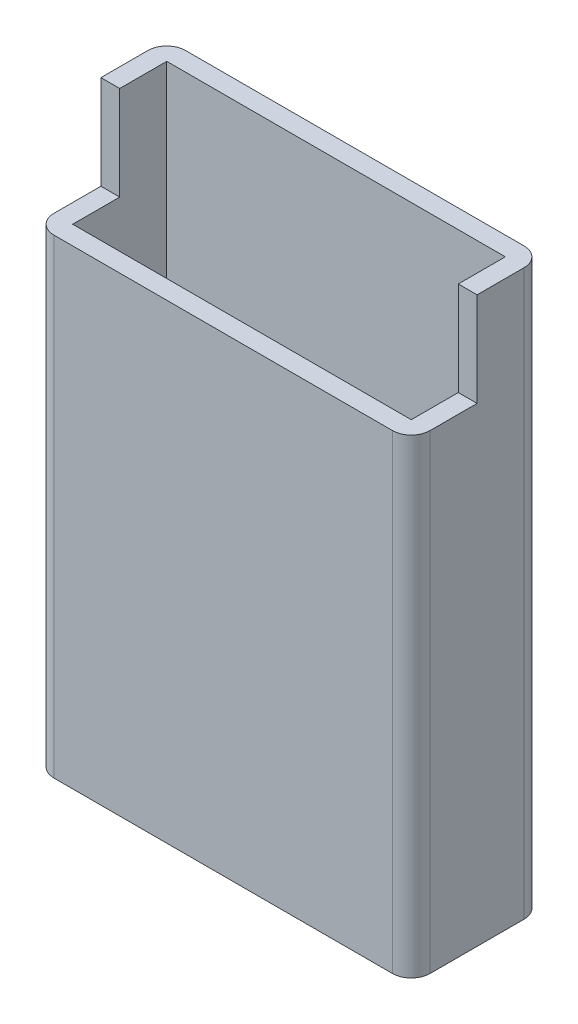
ISO-10303-21;
HEADER;
FILE_DESCRIPTION(('STEP AP214'),'2;1');
FILE_NAME('part.step','',(''),(''),'','','');
FILE_SCHEMA(('AUTOMOTIVE_DESIGN { 1 0 10303 214 1 1 1 1 }'));
ENDSEC;
DATA;
#1=APPLICATION_CONTEXT('core data for automotive mechanical design processes');
#2=APPLICATION_PROTOCOL_DEFINITION('international standard','automotive_design',2000,#1);
#3=PRODUCT_CONTEXT('',#1,'mechanical');
#4=PRODUCT('Part','Part','',(#3));
#5=PRODUCT_RELATED_PRODUCT_CATEGORY('part','',(#4));
#6=PRODUCT_DEFINITION_FORMATION('','',#4);
#7=PRODUCT_DEFINITION_CONTEXT('part definition',#1,'design');
#8=PRODUCT_DEFINITION('design','',#6,#7);
#9=PRODUCT_DEFINITION_SHAPE('','',#8);
#10=(LENGTH_UNIT() NAMED_UNIT(*) SI_UNIT(.MILLI.,.METRE.));
#11=(NAMED_UNIT(*) PLANE_ANGLE_UNIT() SI_UNIT($,.RADIAN.));
#12=(NAMED_UNIT(*) SI_UNIT($,.STERADIAN.) SOLID_ANGLE_UNIT());
#13=UNCERTAINTY_MEASURE_WITH_UNIT(LENGTH_MEASURE(1.E-05),#10,'distance_accuracy_value','');
#14=(GEOMETRIC_REPRESENTATION_CONTEXT(3) GLOBAL_UNCERTAINTY_ASSIGNED_CONTEXT((#13)) GLOBAL_UNIT_ASSIGNED_CONTEXT((#10,
#11,#12)) REPRESENTATION_CONTEXT('',''));
#15=CARTESIAN_POINT('',(0.,0.,0.));
#16=DIRECTION('',(0.,0.,1.));
#17=DIRECTION('',(1.,0.,0.));
#18=AXIS2_PLACEMENT_3D('',#15,#16,#17);
#19=CARTESIAN_POINT('',(0.,60.,0.));
#20=DIRECTION('',(0.,1.,0.));
#21=DIRECTION('',(0.,0.,1.));
#22=AXIS2_PLACEMENT_3D('',#19,#20,#21);
#23=PLANE('',#22);
#24=DIRECTION('',(0.,0.,1.));
#25=VECTOR('',#24,1.);
#26=CARTESIAN_POINT('',(40.,60.,-14.));
#27=LINE('',#26,#25);
#28=CARTESIAN_POINT('',(40.,60.,-12.));
#29=VERTEX_POINT('',#28);
#30=CARTESIAN_POINT('',(40.,60.,-7.));
#31=VERTEX_POINT('',#30);
#32=EDGE_CURVE('E161',#29,#31,#27,.T.);
#33=ORIENTED_EDGE('',*,*,#32,.F.);
#34=CARTESIAN_POINT('',(38.,60.,-12.));
#35=DIRECTION('',(0.,-1.,0.));
#36=DIRECTION('',(0.,0.,-1.));
#37=AXIS2_PLACEMENT_3D('',#34,#35,#36);
#38=CIRCLE('',#37,2.);
#39=CARTESIAN_POINT('',(38.,60.,-14.));
#40=VERTEX_POINT('',#39);
#41=EDGE_CURVE('E146',#40,#29,#38,.T.);
#42=ORIENTED_EDGE('',*,*,#41,.F.);
#43=DIRECTION('',(1.,0.,0.));
#44=VECTOR('',#43,1.);
#45=CARTESIAN_POINT('',(0.,60.,-14.));
#46=LINE('',#45,#44);
#47=CARTESIAN_POINT('',(2.00000000000001,60.,-14.));
#48=VERTEX_POINT('',#47);
#49=EDGE_CURVE('E171',#48,#40,#46,.T.);
#50=ORIENTED_EDGE('',*,*,#49,.F.);
#51=CARTESIAN_POINT('',(2.,60.,-12.));
#52=DIRECTION('',(0.,-1.,0.));
#53=DIRECTION('',(0.,0.,1.));
#54=AXIS2_PLACEMENT_3D('',#51,#52,#53);
#55=CIRCLE('',#54,2.);
#56=CARTESIAN_POINT('',(0.,60.,-12.));
#57=VERTEX_POINT('',#56);
#58=EDGE_CURVE('E154',#57,#48,#55,.T.);
#59=ORIENTED_EDGE('',*,*,#58,.F.);
#60=DIRECTION('',(0.,0.,1.));
#61=VECTOR('',#60,1.);
#62=CARTESIAN_POINT('',(0.,60.,-14.));
#63=LINE('',#62,#61);
#64=CARTESIAN_POINT('',(0.,60.,-7.));
#65=VERTEX_POINT('',#64);
#66=EDGE_CURVE('E172',#57,#65,#63,.T.);
#67=ORIENTED_EDGE('',*,*,#66,.T.);
#68=DIRECTION('',(-1.,0.,0.));
#69=VECTOR('',#68,1.);
#70=CARTESIAN_POINT('',(0.,60.,-7.));
#71=LINE('',#70,#69);
#72=CARTESIAN_POINT('',(2.,60.,-7.));
#73=VERTEX_POINT('',#72);
#74=EDGE_CURVE('E274',#73,#65,#71,.T.);
#75=ORIENTED_EDGE('',*,*,#74,.F.);
#76=DIRECTION('',(0.,0.,-1.));
#77=VECTOR('',#76,1.);
#78=CARTESIAN_POINT('',(2.,60.,-2.));
#79=LINE('',#78,#77);
#80=CARTESIAN_POINT('',(2.,60.,-12.));
#81=VERTEX_POINT('',#80);
#82=EDGE_CURVE('E235',#73,#81,#79,.T.);
#83=ORIENTED_EDGE('',*,*,#82,.T.);
#84=DIRECTION('',(1.,0.,0.));
#85=VECTOR('',#84,1.);
#86=CARTESIAN_POINT('',(2.,60.,-12.));
#87=LINE('',#86,#85);
#88=CARTESIAN_POINT('',(38.,60.,-12.));
#89=VERTEX_POINT('',#88);
#90=EDGE_CURVE('E250',#81,#89,#87,.T.);
#91=ORIENTED_EDGE('',*,*,#90,.T.);
#92=DIRECTION('',(0.,0.,-1.));
#93=VECTOR('',#92,1.);
#94=CARTESIAN_POINT('',(38.,60.,-2.));
#95=LINE('',#94,#93);
#96=CARTESIAN_POINT('',(38.,60.,-7.));
#97=VERTEX_POINT('',#96);
#98=EDGE_CURVE('E240',#97,#89,#95,.T.);
#99=ORIENTED_EDGE('',*,*,#98,.F.);
#100=EDGE_CURVE('E170',#31,#97,#71,.T.);
#101=ORIENTED_EDGE('',*,*,#100,.F.);
#102=EDGE_LOOP('',(#33,#42,#50,#59,#67,#75,#83,#91,#99,#101));
#103=FACE_BOUND('',#102,.T.);
#104=ADVANCED_FACE('F36',(#103),#23,.T.);
#105=CARTESIAN_POINT('',(0.,60.,-14.));
#106=DIRECTION('',(1.,0.,0.));
#107=DIRECTION('',(0.,0.,-1.));
#108=AXIS2_PLACEMENT_3D('',#105,#106,#107);
#109=PLANE('',#108);
#110=ORIENTED_EDGE('',*,*,#66,.F.);
#111=DIRECTION('',(0.,-1.,0.));
#112=VECTOR('',#111,1.);
#113=CARTESIAN_POINT('',(0.,60.,-12.));
#114=LINE('',#113,#112);
#115=CARTESIAN_POINT('',(0.,0.,-12.));
#116=VERTEX_POINT('',#115);
#117=EDGE_CURVE('E289',#57,#116,#114,.T.);
#118=ORIENTED_EDGE('',*,*,#117,.T.);
#119=DIRECTION('',(0.,0.,1.));
#120=VECTOR('',#119,1.);
#121=CARTESIAN_POINT('',(0.,0.,-14.));
#122=LINE('',#121,#120);
#123=CARTESIAN_POINT('',(0.,0.,-2.00000000000001));
#124=VERTEX_POINT('',#123);
#125=EDGE_CURVE('E180',#116,#124,#122,.T.);
#126=ORIENTED_EDGE('',*,*,#125,.T.);
#127=DIRECTION('',(0.,-1.,0.));
#128=VECTOR('',#127,1.);
#129=CARTESIAN_POINT('',(0.,60.,-2.00000000000001));
#130=LINE('',#129,#128);
#131=CARTESIAN_POINT('',(0.,50.,-2.00000000000001));
#132=VERTEX_POINT('',#131);
#133=EDGE_CURVE('E287',#132,#124,#130,.T.);
#134=ORIENTED_EDGE('',*,*,#133,.F.);
#135=DIRECTION('',(0.,0.,1.));
#136=VECTOR('',#135,1.);
#137=CARTESIAN_POINT('',(0.,50.,-7.));
#138=LINE('',#137,#136);
#139=CARTESIAN_POINT('',(0.,50.,-7.));
#140=VERTEX_POINT('',#139);
#141=EDGE_CURVE('E226',#140,#132,#138,.T.);
#142=ORIENTED_EDGE('',*,*,#141,.F.);
#143=DIRECTION('',(0.,-1.,0.));
#144=VECTOR('',#143,1.);
#145=CARTESIAN_POINT('',(0.,60.,-7.));
#146=LINE('',#145,#144);
#147=EDGE_CURVE('E214',#65,#140,#146,.T.);
#148=ORIENTED_EDGE('',*,*,#147,.F.);
#149=EDGE_LOOP('',(#110,#118,#126,#134,#142,#148));
#150=FACE_BOUND('',#149,.T.);
#151=ADVANCED_FACE('F38',(#150),#109,.F.);
#152=CARTESIAN_POINT('',(0.,60.,0.));
#153=DIRECTION('',(0.,0.,-1.));
#154=DIRECTION('',(-1.,0.,0.));
#155=AXIS2_PLACEMENT_3D('',#152,#153,#154);
#156=PLANE('',#155);
#157=DIRECTION('',(1.,0.,0.));
#158=VECTOR('',#157,1.);
#159=CARTESIAN_POINT('',(0.,50.,0.));
#160=LINE('',#159,#158);
#161=CARTESIAN_POINT('',(2.00000000000001,50.,0.));
#162=VERTEX_POINT('',#161);
#163=CARTESIAN_POINT('',(38.,50.,0.));
#164=VERTEX_POINT('',#163);
#165=EDGE_CURVE('E207',#162,#164,#160,.T.);
#166=ORIENTED_EDGE('',*,*,#165,.F.);
#167=DIRECTION('',(0.,-1.,0.));
#168=VECTOR('',#167,1.);
#169=CARTESIAN_POINT('',(2.00000000000001,60.,0.));
#170=LINE('',#169,#168);
#171=CARTESIAN_POINT('',(2.00000000000001,0.,0.));
#172=VERTEX_POINT('',#171);
#173=EDGE_CURVE('E209',#162,#172,#170,.T.);
#174=ORIENTED_EDGE('',*,*,#173,.T.);
#175=DIRECTION('',(1.,0.,0.));
#176=VECTOR('',#175,1.);
#177=CARTESIAN_POINT('',(0.,0.,0.));
#178=LINE('',#177,#176);
#179=CARTESIAN_POINT('',(38.,0.,0.));
#180=VERTEX_POINT('',#179);
#181=EDGE_CURVE('E183',#172,#180,#178,.T.);
#182=ORIENTED_EDGE('',*,*,#181,.T.);
#183=DIRECTION('',(0.,-1.,0.));
#184=VECTOR('',#183,1.);
#185=CARTESIAN_POINT('',(38.,60.,0.));
#186=LINE('',#185,#184);
#187=EDGE_CURVE('E197',#164,#180,#186,.T.);
#188=ORIENTED_EDGE('',*,*,#187,.F.);
#189=EDGE_LOOP('',(#166,#174,#182,#188));
#190=FACE_BOUND('',#189,.T.);
#191=ADVANCED_FACE('F205',(#190),#156,.F.);
#192=CARTESIAN_POINT('',(40.,60.,-14.));
#193=DIRECTION('',(1.,0.,0.));
#194=DIRECTION('',(0.,0.,-1.));
#195=AXIS2_PLACEMENT_3D('',#192,#193,#194);
#196=PLANE('',#195);
#197=DIRECTION('',(0.,-1.,0.));
#198=VECTOR('',#197,1.);
#199=CARTESIAN_POINT('',(40.,60.,-12.));
#200=LINE('',#199,#198);
#201=CARTESIAN_POINT('',(40.,0.,-12.));
#202=VERTEX_POINT('',#201);
#203=EDGE_CURVE('E51',#29,#202,#200,.T.);
#204=ORIENTED_EDGE('',*,*,#203,.F.);
#205=ORIENTED_EDGE('',*,*,#32,.T.);
#206=DIRECTION('',(0.,1.,0.));
#207=VECTOR('',#206,1.);
#208=CARTESIAN_POINT('',(40.,60.,-7.));
#209=LINE('',#208,#207);
#210=CARTESIAN_POINT('',(40.,50.,-7.));
#211=VERTEX_POINT('',#210);
#212=EDGE_CURVE('E279',#211,#31,#209,.T.);
#213=ORIENTED_EDGE('',*,*,#212,.F.);
#214=DIRECTION('',(0.,0.,1.));
#215=VECTOR('',#214,1.);
#216=CARTESIAN_POINT('',(40.,50.,-7.));
#217=LINE('',#216,#215);
#218=CARTESIAN_POINT('',(40.,50.,-2.00000000000001));
#219=VERTEX_POINT('',#218);
#220=EDGE_CURVE('E223',#211,#219,#217,.T.);
#221=ORIENTED_EDGE('',*,*,#220,.T.);
#222=DIRECTION('',(0.,-1.,0.));
#223=VECTOR('',#222,1.);
#224=CARTESIAN_POINT('',(40.,60.,-2.00000000000001));
#225=LINE('',#224,#223);
#226=CARTESIAN_POINT('',(40.,0.,-2.00000000000001));
#227=VERTEX_POINT('',#226);
#228=EDGE_CURVE('E166',#219,#227,#225,.T.);
#229=ORIENTED_EDGE('',*,*,#228,.T.);
#230=DIRECTION('',(0.,0.,1.));
#231=VECTOR('',#230,1.);
#232=CARTESIAN_POINT('',(40.,0.,-14.));
#233=LINE('',#232,#231);
#234=EDGE_CURVE('E165',#202,#227,#233,.T.);
#235=ORIENTED_EDGE('',*,*,#234,.F.);
#236=EDGE_LOOP('',(#204,#205,#213,#221,#229,#235));
#237=FACE_BOUND('',#236,.T.);
#238=ADVANCED_FACE('F159',(#237),#196,.T.);
#239=CARTESIAN_POINT('',(0.,60.,-14.));
#240=DIRECTION('',(0.,0.,-1.));
#241=DIRECTION('',(-1.,0.,0.));
#242=AXIS2_PLACEMENT_3D('',#239,#240,#241);
#243=PLANE('',#242);
#244=ORIENTED_EDGE('',*,*,#49,.T.);
#245=DIRECTION('',(0.,-1.,0.));
#246=VECTOR('',#245,1.);
#247=CARTESIAN_POINT('',(38.,60.,-14.));
#248=LINE('',#247,#246);
#249=CARTESIAN_POINT('',(38.,0.,-14.));
#250=VERTEX_POINT('',#249);
#251=EDGE_CURVE('E149',#40,#250,#248,.T.);
#252=ORIENTED_EDGE('',*,*,#251,.T.);
#253=DIRECTION('',(1.,0.,0.));
#254=VECTOR('',#253,1.);
#255=CARTESIAN_POINT('',(0.,0.,-14.));
#256=LINE('',#255,#254);
#257=CARTESIAN_POINT('',(2.,0.,-14.));
#258=VERTEX_POINT('',#257);
#259=EDGE_CURVE('E176',#258,#250,#256,.T.);
#260=ORIENTED_EDGE('',*,*,#259,.F.);
#261=DIRECTION('',(0.,-1.,0.));
#262=VECTOR('',#261,1.);
#263=CARTESIAN_POINT('',(2.00000000000001,60.,-14.));
#264=LINE('',#263,#262);
#265=EDGE_CURVE('E59',#48,#258,#264,.T.);
#266=ORIENTED_EDGE('',*,*,#265,.F.);
#267=EDGE_LOOP('',(#244,#252,#260,#266));
#268=FACE_BOUND('',#267,.T.);
#269=ADVANCED_FACE('F304',(#268),#243,.T.);
#270=CARTESIAN_POINT('',(0.,0.,0.));
#271=DIRECTION('',(0.,1.,0.));
#272=DIRECTION('',(0.,0.,1.));
#273=AXIS2_PLACEMENT_3D('',#270,#271,#272);
#274=PLANE('',#273);
#275=CARTESIAN_POINT('',(38.,0.,-12.));
#276=DIRECTION('',(0.,-1.,0.));
#277=DIRECTION('',(0.,0.,-1.));
#278=AXIS2_PLACEMENT_3D('',#275,#276,#277);
#279=CIRCLE('',#278,2.);
#280=EDGE_CURVE('E299',#250,#202,#279,.T.);
#281=ORIENTED_EDGE('',*,*,#280,.T.);
#282=ORIENTED_EDGE('',*,*,#234,.T.);
#283=CARTESIAN_POINT('',(38.,0.,-2.));
#284=DIRECTION('',(0.,-1.,0.));
#285=DIRECTION('',(0.,0.,1.));
#286=AXIS2_PLACEMENT_3D('',#283,#284,#285);
#287=CIRCLE('',#286,2.);
#288=EDGE_CURVE('E297',#227,#180,#287,.T.);
#289=ORIENTED_EDGE('',*,*,#288,.T.);
#290=ORIENTED_EDGE('',*,*,#181,.F.);
#291=CARTESIAN_POINT('',(2.,0.,-2.));
#292=DIRECTION('',(0.,-1.,0.));
#293=DIRECTION('',(0.,0.,1.));
#294=AXIS2_PLACEMENT_3D('',#291,#292,#293);
#295=CIRCLE('',#294,2.);
#296=EDGE_CURVE('E294',#172,#124,#295,.T.);
#297=ORIENTED_EDGE('',*,*,#296,.T.);
#298=ORIENTED_EDGE('',*,*,#125,.F.);
#299=CARTESIAN_POINT('',(2.,0.,-12.));
#300=DIRECTION('',(0.,-1.,0.));
#301=DIRECTION('',(0.,0.,1.));
#302=AXIS2_PLACEMENT_3D('',#299,#300,#301);
#303=CIRCLE('',#302,2.);
#304=EDGE_CURVE('E155',#116,#258,#303,.T.);
#305=ORIENTED_EDGE('',*,*,#304,.T.);
#306=ORIENTED_EDGE('',*,*,#259,.T.);
#307=EDGE_LOOP('',(#281,#282,#289,#290,#297,#298,#305,#306));
#308=FACE_BOUND('',#307,.T.);
#309=ADVANCED_FACE('F306',(#308),#274,.F.);
#310=CARTESIAN_POINT('',(0.,50.,-7.));
#311=DIRECTION('',(0.,-1.,0.));
#312=DIRECTION('',(0.,0.,-1.));
#313=AXIS2_PLACEMENT_3D('',#310,#311,#312);
#314=PLANE('',#313);
#315=CARTESIAN_POINT('',(2.,50.,-2.));
#316=DIRECTION('',(0.,-1.,0.));
#317=DIRECTION('',(0.,0.,-1.));
#318=AXIS2_PLACEMENT_3D('',#315,#316,#317);
#319=CIRCLE('',#318,2.);
#320=EDGE_CURVE('E12',#162,#132,#319,.T.);
#321=ORIENTED_EDGE('',*,*,#320,.F.);
#322=ORIENTED_EDGE('',*,*,#165,.T.);
#323=CARTESIAN_POINT('',(38.,50.,-2.));
#324=DIRECTION('',(0.,-1.,0.));
#325=DIRECTION('',(0.,0.,-1.));
#326=AXIS2_PLACEMENT_3D('',#323,#324,#325);
#327=CIRCLE('',#326,2.);
#328=EDGE_CURVE('E44',#219,#164,#327,.T.);
#329=ORIENTED_EDGE('',*,*,#328,.F.);
#330=ORIENTED_EDGE('',*,*,#220,.F.);
#331=DIRECTION('',(1.,0.,0.));
#332=VECTOR('',#331,1.);
#333=CARTESIAN_POINT('',(0.,50.,-7.));
#334=LINE('',#333,#332);
#335=CARTESIAN_POINT('',(38.,50.,-7.));
#336=VERTEX_POINT('',#335);
#337=EDGE_CURVE('E217',#336,#211,#334,.T.);
#338=ORIENTED_EDGE('',*,*,#337,.F.);
#339=DIRECTION('',(0.,0.,-1.));
#340=VECTOR('',#339,1.);
#341=CARTESIAN_POINT('',(38.,50.,-2.));
#342=LINE('',#341,#340);
#343=CARTESIAN_POINT('',(38.,50.,-2.));
#344=VERTEX_POINT('',#343);
#345=EDGE_CURVE('E225',#344,#336,#342,.T.);
#346=ORIENTED_EDGE('',*,*,#345,.F.);
#347=DIRECTION('',(1.,0.,0.));
#348=VECTOR('',#347,1.);
#349=CARTESIAN_POINT('',(2.,50.,-2.));
#350=LINE('',#349,#348);
#351=CARTESIAN_POINT('',(2.,50.,-2.));
#352=VERTEX_POINT('',#351);
#353=EDGE_CURVE('E174',#352,#344,#350,.T.);
#354=ORIENTED_EDGE('',*,*,#353,.F.);
#355=DIRECTION('',(0.,0.,-1.));
#356=VECTOR('',#355,1.);
#357=CARTESIAN_POINT('',(2.,50.,-2.));
#358=LINE('',#357,#356);
#359=CARTESIAN_POINT('',(2.,50.,-7.));
#360=VERTEX_POINT('',#359);
#361=EDGE_CURVE('E230',#352,#360,#358,.T.);
#362=ORIENTED_EDGE('',*,*,#361,.T.);
#363=EDGE_CURVE('E280',#140,#360,#334,.T.);
#364=ORIENTED_EDGE('',*,*,#363,.F.);
#365=ORIENTED_EDGE('',*,*,#141,.T.);
#366=EDGE_LOOP('',(#321,#322,#329,#330,#338,#346,#354,#362,#364,#365));
#367=FACE_BOUND('',#366,.T.);
#368=ADVANCED_FACE('F212',(#367),#314,.F.);
#369=CARTESIAN_POINT('',(2.,5.,-2.));
#370=DIRECTION('',(1.,0.,0.));
#371=DIRECTION('',(0.,0.,-1.));
#372=AXIS2_PLACEMENT_3D('',#369,#370,#371);
#373=PLANE('',#372);
#374=ORIENTED_EDGE('',*,*,#361,.F.);
#375=DIRECTION('',(0.,1.,0.));
#376=VECTOR('',#375,1.);
#377=CARTESIAN_POINT('',(2.,5.,-2.));
#378=LINE('',#377,#376);
#379=CARTESIAN_POINT('',(2.,5.,-2.));
#380=VERTEX_POINT('',#379);
#381=EDGE_CURVE('E248',#380,#352,#378,.T.);
#382=ORIENTED_EDGE('',*,*,#381,.F.);
#383=DIRECTION('',(0.,0.,-1.));
#384=VECTOR('',#383,1.);
#385=CARTESIAN_POINT('',(2.,5.,-2.));
#386=LINE('',#385,#384);
#387=CARTESIAN_POINT('',(2.,5.,-12.));
#388=VERTEX_POINT('',#387);
#389=EDGE_CURVE('E236',#380,#388,#386,.T.);
#390=ORIENTED_EDGE('',*,*,#389,.T.);
#391=DIRECTION('',(0.,1.,0.));
#392=VECTOR('',#391,1.);
#393=CARTESIAN_POINT('',(2.,5.,-12.));
#394=LINE('',#393,#392);
#395=EDGE_CURVE('E184',#388,#81,#394,.T.);
#396=ORIENTED_EDGE('',*,*,#395,.T.);
#397=ORIENTED_EDGE('',*,*,#82,.F.);
#398=DIRECTION('',(0.,-1.,0.));
#399=VECTOR('',#398,1.);
#400=CARTESIAN_POINT('',(2.,5.,-7.));
#401=LINE('',#400,#399);
#402=EDGE_CURVE('E232',#73,#360,#401,.T.);
#403=ORIENTED_EDGE('',*,*,#402,.T.);
#404=EDGE_LOOP('',(#374,#382,#390,#396,#397,#403));
#405=FACE_BOUND('',#404,.T.);
#406=ADVANCED_FACE('F266',(#405),#373,.T.);
#407=CARTESIAN_POINT('',(2.,5.,-12.));
#408=DIRECTION('',(0.,0.,1.));
#409=DIRECTION('',(1.,0.,0.));
#410=AXIS2_PLACEMENT_3D('',#407,#408,#409);
#411=PLANE('',#410);
#412=ORIENTED_EDGE('',*,*,#90,.F.);
#413=ORIENTED_EDGE('',*,*,#395,.F.);
#414=DIRECTION('',(1.,0.,0.));
#415=VECTOR('',#414,1.);
#416=CARTESIAN_POINT('',(2.,5.,-12.));
#417=LINE('',#416,#415);
#418=CARTESIAN_POINT('',(38.,5.,-12.));
#419=VERTEX_POINT('',#418);
#420=EDGE_CURVE('E239',#388,#419,#417,.T.);
#421=ORIENTED_EDGE('',*,*,#420,.T.);
#422=DIRECTION('',(0.,1.,0.));
#423=VECTOR('',#422,1.);
#424=CARTESIAN_POINT('',(38.,5.,-12.));
#425=LINE('',#424,#423);
#426=EDGE_CURVE('E259',#419,#89,#425,.T.);
#427=ORIENTED_EDGE('',*,*,#426,.T.);
#428=EDGE_LOOP('',(#412,#413,#421,#427));
#429=FACE_BOUND('',#428,.T.);
#430=ADVANCED_FACE('F270',(#429),#411,.T.);
#431=CARTESIAN_POINT('',(38.,5.,-2.));
#432=DIRECTION('',(1.,0.,0.));
#433=DIRECTION('',(0.,0.,-1.));
#434=AXIS2_PLACEMENT_3D('',#431,#432,#433);
#435=PLANE('',#434);
#436=DIRECTION('',(0.,1.,0.));
#437=VECTOR('',#436,1.);
#438=CARTESIAN_POINT('',(38.,5.,-2.));
#439=LINE('',#438,#437);
#440=CARTESIAN_POINT('',(38.,5.,-2.));
#441=VERTEX_POINT('',#440);
#442=EDGE_CURVE('E256',#441,#344,#439,.T.);
#443=ORIENTED_EDGE('',*,*,#442,.T.);
#444=ORIENTED_EDGE('',*,*,#345,.T.);
#445=DIRECTION('',(0.,-1.,0.));
#446=VECTOR('',#445,1.);
#447=CARTESIAN_POINT('',(38.,5.,-7.));
#448=LINE('',#447,#446);
#449=EDGE_CURVE('E192',#97,#336,#448,.T.);
#450=ORIENTED_EDGE('',*,*,#449,.F.);
#451=ORIENTED_EDGE('',*,*,#98,.T.);
#452=ORIENTED_EDGE('',*,*,#426,.F.);
#453=DIRECTION('',(0.,0.,-1.));
#454=VECTOR('',#453,1.);
#455=CARTESIAN_POINT('',(38.,5.,-2.));
#456=LINE('',#455,#454);
#457=EDGE_CURVE('E242',#441,#419,#456,.T.);
#458=ORIENTED_EDGE('',*,*,#457,.F.);
#459=EDGE_LOOP('',(#443,#444,#450,#451,#452,#458));
#460=FACE_BOUND('',#459,.T.);
#461=ADVANCED_FACE('F319',(#460),#435,.F.);
#462=CARTESIAN_POINT('',(2.,5.,-2.));
#463=DIRECTION('',(0.,0.,1.));
#464=DIRECTION('',(1.,0.,0.));
#465=AXIS2_PLACEMENT_3D('',#462,#463,#464);
#466=PLANE('',#465);
#467=ORIENTED_EDGE('',*,*,#381,.T.);
#468=ORIENTED_EDGE('',*,*,#353,.T.);
#469=ORIENTED_EDGE('',*,*,#442,.F.);
#470=DIRECTION('',(1.,0.,0.));
#471=VECTOR('',#470,1.);
#472=CARTESIAN_POINT('',(2.,5.,-2.));
#473=LINE('',#472,#471);
#474=EDGE_CURVE('E245',#380,#441,#473,.T.);
#475=ORIENTED_EDGE('',*,*,#474,.F.);
#476=EDGE_LOOP('',(#467,#468,#469,#475));
#477=FACE_BOUND('',#476,.T.);
#478=ADVANCED_FACE('F314',(#477),#466,.F.);
#479=CARTESIAN_POINT('',(0.,5.,0.));
#480=DIRECTION('',(0.,-1.,0.));
#481=DIRECTION('',(0.,0.,-1.));
#482=AXIS2_PLACEMENT_3D('',#479,#480,#481);
#483=PLANE('',#482);
#484=ORIENTED_EDGE('',*,*,#389,.F.);
#485=ORIENTED_EDGE('',*,*,#474,.T.);
#486=ORIENTED_EDGE('',*,*,#457,.T.);
#487=ORIENTED_EDGE('',*,*,#420,.F.);
#488=EDGE_LOOP('',(#484,#485,#486,#487));
#489=FACE_BOUND('',#488,.T.);
#490=ADVANCED_FACE('F317',(#489),#483,.F.);
#491=CARTESIAN_POINT('',(0.,0.,-7.));
#492=DIRECTION('',(0.,0.,1.));
#493=DIRECTION('',(1.,0.,0.));
#494=AXIS2_PLACEMENT_3D('',#491,#492,#493);
#495=PLANE('',#494);
#496=ORIENTED_EDGE('',*,*,#449,.T.);
#497=ORIENTED_EDGE('',*,*,#337,.T.);
#498=ORIENTED_EDGE('',*,*,#212,.T.);
#499=ORIENTED_EDGE('',*,*,#100,.T.);
#500=EDGE_LOOP('',(#496,#497,#498,#499));
#501=FACE_BOUND('',#500,.T.);
#502=ADVANCED_FACE('F322',(#501),#495,.T.);
#503=ORIENTED_EDGE('',*,*,#74,.T.);
#504=ORIENTED_EDGE('',*,*,#147,.T.);
#505=ORIENTED_EDGE('',*,*,#363,.T.);
#506=ORIENTED_EDGE('',*,*,#402,.F.);
#507=EDGE_LOOP('',(#503,#504,#505,#506));
#508=FACE_BOUND('',#507,.T.);
#509=ADVANCED_FACE('F311',(#508),#495,.T.);
#510=CARTESIAN_POINT('',(38.,60.,-2.));
#511=DIRECTION('',(0.,-1.,0.));
#512=DIRECTION('',(0.,0.,-1.));
#513=AXIS2_PLACEMENT_3D('',#510,#511,#512);
#514=CYLINDRICAL_SURFACE('',#513,2.);
#515=ORIENTED_EDGE('',*,*,#328,.T.);
#516=ORIENTED_EDGE('',*,*,#187,.T.);
#517=ORIENTED_EDGE('',*,*,#288,.F.);
#518=ORIENTED_EDGE('',*,*,#228,.F.);
#519=EDGE_LOOP('',(#515,#516,#517,#518));
#520=FACE_BOUND('',#519,.T.);
#521=ADVANCED_FACE('F196',(#520),#514,.T.);
#522=CARTESIAN_POINT('',(2.,60.,-2.));
#523=DIRECTION('',(0.,-1.,0.));
#524=DIRECTION('',(0.,0.,-1.));
#525=AXIS2_PLACEMENT_3D('',#522,#523,#524);
#526=CYLINDRICAL_SURFACE('',#525,2.);
#527=ORIENTED_EDGE('',*,*,#320,.T.);
#528=ORIENTED_EDGE('',*,*,#133,.T.);
#529=ORIENTED_EDGE('',*,*,#296,.F.);
#530=ORIENTED_EDGE('',*,*,#173,.F.);
#531=EDGE_LOOP('',(#527,#528,#529,#530));
#532=FACE_BOUND('',#531,.T.);
#533=ADVANCED_FACE('F324',(#532),#526,.T.);
#534=CARTESIAN_POINT('',(2.,60.,-12.));
#535=DIRECTION('',(0.,-1.,0.));
#536=DIRECTION('',(0.,0.,-1.));
#537=AXIS2_PLACEMENT_3D('',#534,#535,#536);
#538=CYLINDRICAL_SURFACE('',#537,2.);
#539=ORIENTED_EDGE('',*,*,#304,.F.);
#540=ORIENTED_EDGE('',*,*,#117,.F.);
#541=ORIENTED_EDGE('',*,*,#58,.T.);
#542=ORIENTED_EDGE('',*,*,#265,.T.);
#543=EDGE_LOOP('',(#539,#540,#541,#542));
#544=FACE_BOUND('',#543,.T.);
#545=ADVANCED_FACE('F301',(#544),#538,.T.);
#546=CARTESIAN_POINT('',(38.,60.,-12.));
#547=DIRECTION('',(0.,-1.,0.));
#548=DIRECTION('',(0.,0.,-1.));
#549=AXIS2_PLACEMENT_3D('',#546,#547,#548);
#550=CYLINDRICAL_SURFACE('',#549,2.);
#551=ORIENTED_EDGE('',*,*,#280,.F.);
#552=ORIENTED_EDGE('',*,*,#251,.F.);
#553=ORIENTED_EDGE('',*,*,#41,.T.);
#554=ORIENTED_EDGE('',*,*,#203,.T.);
#555=EDGE_LOOP('',(#551,#552,#553,#554));
#556=FACE_BOUND('',#555,.T.);
#557=ADVANCED_FACE('F147',(#556),#550,.T.);
#558=CLOSED_SHELL('',(#104,#151,#191,#238,#269,#309,#368,#406,#430,#461,#478,#490,#502,#509,
#521,#533,#545,#557));
#559=MANIFOLD_SOLID_BREP('B2',#558);
#560=ADVANCED_BREP_SHAPE_REPRESENTATION('',(#18,#559),#14);
#561=SHAPE_DEFINITION_REPRESENTATION(#9,#560);
ENDSEC;
END-ISO-10303-21;
